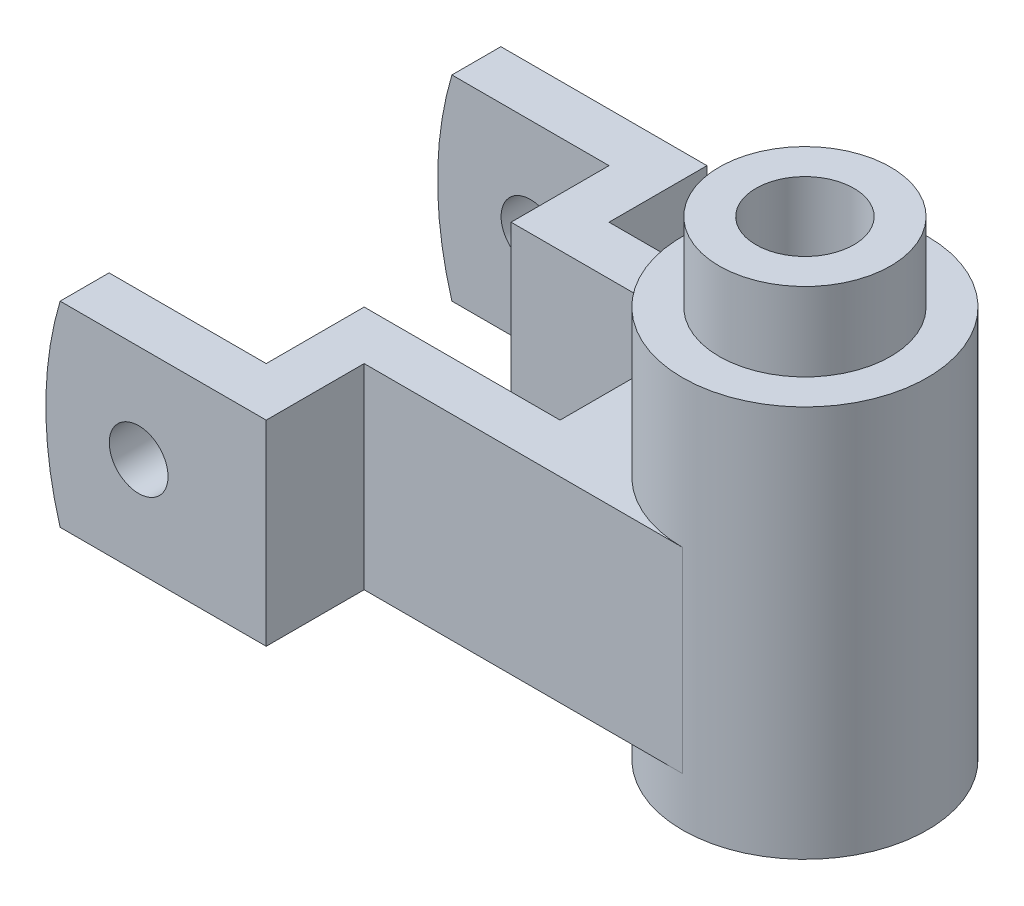
ISO-10303-21;
HEADER;
FILE_DESCRIPTION(('STEP AP214'),'2;1');
FILE_NAME('part.step','',(''),(''),'','','');
FILE_SCHEMA(('AUTOMOTIVE_DESIGN { 1 0 10303 214 1 1 1 1 }'));
ENDSEC;
DATA;
#1=APPLICATION_CONTEXT('core data for automotive mechanical design processes');
#2=APPLICATION_PROTOCOL_DEFINITION('international standard','automotive_design',2000,#1);
#3=PRODUCT_CONTEXT('',#1,'mechanical');
#4=PRODUCT('Part','Part','',(#3));
#5=PRODUCT_RELATED_PRODUCT_CATEGORY('part','',(#4));
#6=PRODUCT_DEFINITION_FORMATION('','',#4);
#7=PRODUCT_DEFINITION_CONTEXT('part definition',#1,'design');
#8=PRODUCT_DEFINITION('design','',#6,#7);
#9=PRODUCT_DEFINITION_SHAPE('','',#8);
#10=(LENGTH_UNIT() NAMED_UNIT(*) SI_UNIT(.MILLI.,.METRE.));
#11=(NAMED_UNIT(*) PLANE_ANGLE_UNIT() SI_UNIT($,.RADIAN.));
#12=(NAMED_UNIT(*) SI_UNIT($,.STERADIAN.) SOLID_ANGLE_UNIT());
#13=UNCERTAINTY_MEASURE_WITH_UNIT(LENGTH_MEASURE(1.E-05),#10,'distance_accuracy_value','');
#14=(GEOMETRIC_REPRESENTATION_CONTEXT(3) GLOBAL_UNCERTAINTY_ASSIGNED_CONTEXT((#13)) GLOBAL_UNIT_ASSIGNED_CONTEXT((#10,
#11,#12)) REPRESENTATION_CONTEXT('',''));
#15=CARTESIAN_POINT('',(0.,0.,0.));
#16=DIRECTION('',(0.,0.,1.));
#17=DIRECTION('',(1.,0.,0.));
#18=AXIS2_PLACEMENT_3D('',#15,#16,#17);
#19=CARTESIAN_POINT('',(-56.2735173731658,40.,-36.0168659088266));
#20=DIRECTION('',(0.,0.,1.));
#21=DIRECTION('',(1.,0.,0.));
#22=AXIS2_PLACEMENT_3D('',#19,#20,#21);
#23=PLANE('',#22);
#24=CARTESIAN_POINT('',(-37.3145370356626,20.,-36.0168659088266));
#25=DIRECTION('',(0.,0.,1.));
#26=DIRECTION('',(1.,0.,0.));
#27=AXIS2_PLACEMENT_3D('',#24,#25,#26);
#28=CIRCLE('',#27,6.);
#29=CARTESIAN_POINT('',(-31.3145370356626,20.,-36.0168659088266));
#30=VERTEX_POINT('',#29);
#31=EDGE_CURVE('E254',#30,#30,#28,.F.);
#32=ORIENTED_EDGE('',*,*,#31,.F.);
#33=EDGE_LOOP('',(#32));
#34=FACE_BOUND('',#33,.T.);
#35=CARTESIAN_POINT('',(13.7264826268342,20.,-36.0168659088266));
#36=DIRECTION('',(0.,0.,1.));
#37=DIRECTION('',(1.,0.,0.));
#38=AXIS2_PLACEMENT_3D('',#35,#36,#37);
#39=CIRCLE('',#38,70.);
#40=CARTESIAN_POINT('',(-53.3555566981594,40.,-36.0168659088266));
#41=VERTEX_POINT('',#40);
#42=CARTESIAN_POINT('',(-53.3555566981594,0.,-36.0168659088266));
#43=VERTEX_POINT('',#42);
#44=EDGE_CURVE('E60',#41,#43,#39,.T.);
#45=ORIENTED_EDGE('',*,*,#44,.F.);
#46=DIRECTION('',(-1.,0.,0.));
#47=VECTOR('',#46,1.);
#48=CARTESIAN_POINT('',(-56.2735173731658,40.,-36.0168659088266));
#49=LINE('',#48,#47);
#50=CARTESIAN_POINT('',(-11.2735173731658,40.,-36.0168659088266));
#51=VERTEX_POINT('',#50);
#52=EDGE_CURVE('E212',#51,#41,#49,.T.);
#53=ORIENTED_EDGE('',*,*,#52,.F.);
#54=DIRECTION('',(0.,-1.,0.));
#55=VECTOR('',#54,1.);
#56=CARTESIAN_POINT('',(-11.2735173731658,40.,-36.0168659088266));
#57=LINE('',#56,#55);
#58=CARTESIAN_POINT('',(-11.2735173731658,0.,-36.0168659088266));
#59=VERTEX_POINT('',#58);
#60=EDGE_CURVE('E176',#51,#59,#57,.T.);
#61=ORIENTED_EDGE('',*,*,#60,.T.);
#62=DIRECTION('',(-1.,0.,0.));
#63=VECTOR('',#62,1.);
#64=CARTESIAN_POINT('',(-56.2735173731658,0.,-36.0168659088266));
#65=LINE('',#64,#63);
#66=EDGE_CURVE('E182',#59,#43,#65,.T.);
#67=ORIENTED_EDGE('',*,*,#66,.T.);
#68=EDGE_LOOP('',(#45,#53,#61,#67));
#69=FACE_BOUND('',#68,.T.);
#70=ADVANCED_FACE('F37',(#34,#69),#23,.F.);
#71=CARTESIAN_POINT('',(-56.2735173731658,40.,-26.0168659088266));
#72=DIRECTION('',(0.,0.,-1.));
#73=DIRECTION('',(-1.,0.,0.));
#74=AXIS2_PLACEMENT_3D('',#71,#72,#73);
#75=PLANE('',#74);
#76=CARTESIAN_POINT('',(-37.3145370356626,20.,-26.0168659088266));
#77=DIRECTION('',(0.,0.,-1.));
#78=DIRECTION('',(-1.,0.,0.));
#79=AXIS2_PLACEMENT_3D('',#76,#77,#78);
#80=CIRCLE('',#79,6.);
#81=CARTESIAN_POINT('',(-43.3145370356626,20.,-26.0168659088266));
#82=VERTEX_POINT('',#81);
#83=EDGE_CURVE('E249',#82,#82,#80,.F.);
#84=ORIENTED_EDGE('',*,*,#83,.F.);
#85=EDGE_LOOP('',(#84));
#86=FACE_BOUND('',#85,.T.);
#87=DIRECTION('',(1.,0.,0.));
#88=VECTOR('',#87,1.);
#89=CARTESIAN_POINT('',(-56.2735173731658,40.,-26.0168659088266));
#90=LINE('',#89,#88);
#91=CARTESIAN_POINT('',(-53.3555566981594,40.,-26.0168659088266));
#92=VERTEX_POINT('',#91);
#93=CARTESIAN_POINT('',(-21.2735173731658,40.,-26.0168659088266));
#94=VERTEX_POINT('',#93);
#95=EDGE_CURVE('E273',#92,#94,#90,.T.);
#96=ORIENTED_EDGE('',*,*,#95,.F.);
#97=CARTESIAN_POINT('',(13.7264826268342,20.,-26.0168659088266));
#98=DIRECTION('',(0.,0.,-1.));
#99=DIRECTION('',(-1.,0.,0.));
#100=AXIS2_PLACEMENT_3D('',#97,#98,#99);
#101=CIRCLE('',#100,70.);
#102=CARTESIAN_POINT('',(-53.3555566981594,0.,-26.0168659088266));
#103=VERTEX_POINT('',#102);
#104=EDGE_CURVE('E186',#103,#92,#101,.T.);
#105=ORIENTED_EDGE('',*,*,#104,.F.);
#106=DIRECTION('',(1.,0.,0.));
#107=VECTOR('',#106,1.);
#108=CARTESIAN_POINT('',(-56.2735173731658,0.,-26.0168659088266));
#109=LINE('',#108,#107);
#110=CARTESIAN_POINT('',(-21.2735173731658,0.,-26.0168659088266));
#111=VERTEX_POINT('',#110);
#112=EDGE_CURVE('E185',#103,#111,#109,.T.);
#113=ORIENTED_EDGE('',*,*,#112,.T.);
#114=DIRECTION('',(0.,-1.,0.));
#115=VECTOR('',#114,1.);
#116=CARTESIAN_POINT('',(-21.2735173731658,40.,-26.0168659088266));
#117=LINE('',#116,#115);
#118=EDGE_CURVE('E238',#94,#111,#117,.T.);
#119=ORIENTED_EDGE('',*,*,#118,.F.);
#120=EDGE_LOOP('',(#96,#105,#113,#119));
#121=FACE_BOUND('',#120,.T.);
#122=ADVANCED_FACE('F337',(#86,#121),#75,.F.);
#123=CARTESIAN_POINT('',(-21.2735173731658,40.,43.9831340911734));
#124=DIRECTION('',(0.,0.,1.));
#125=DIRECTION('',(1.,0.,0.));
#126=AXIS2_PLACEMENT_3D('',#123,#124,#125);
#127=PLANE('',#126);
#128=CARTESIAN_POINT('',(-37.3145370356626,20.,43.9831340911734));
#129=DIRECTION('',(0.,0.,1.));
#130=DIRECTION('',(1.,0.,0.));
#131=AXIS2_PLACEMENT_3D('',#128,#129,#130);
#132=CIRCLE('',#131,6.);
#133=CARTESIAN_POINT('',(-31.3145370356626,20.,43.9831340911734));
#134=VERTEX_POINT('',#133);
#135=EDGE_CURVE('E245',#134,#134,#132,.F.);
#136=ORIENTED_EDGE('',*,*,#135,.F.);
#137=EDGE_LOOP('',(#136));
#138=FACE_BOUND('',#137,.T.);
#139=CARTESIAN_POINT('',(13.7264826268342,20.,43.9831340911734));
#140=DIRECTION('',(0.,0.,1.));
#141=DIRECTION('',(1.,0.,0.));
#142=AXIS2_PLACEMENT_3D('',#139,#140,#141);
#143=CIRCLE('',#142,70.);
#144=CARTESIAN_POINT('',(-53.3555566981594,40.,43.9831340911733));
#145=VERTEX_POINT('',#144);
#146=CARTESIAN_POINT('',(-53.3555566981594,0.,43.9831340911734));
#147=VERTEX_POINT('',#146);
#148=EDGE_CURVE('E52',#145,#147,#143,.T.);
#149=ORIENTED_EDGE('',*,*,#148,.F.);
#150=DIRECTION('',(-1.,0.,0.));
#151=VECTOR('',#150,1.);
#152=CARTESIAN_POINT('',(-21.2735173731658,40.,43.9831340911734));
#153=LINE('',#152,#151);
#154=CARTESIAN_POINT('',(-21.2735173731658,40.,43.9831340911734));
#155=VERTEX_POINT('',#154);
#156=EDGE_CURVE('E285',#155,#145,#153,.T.);
#157=ORIENTED_EDGE('',*,*,#156,.F.);
#158=DIRECTION('',(0.,-1.,0.));
#159=VECTOR('',#158,1.);
#160=CARTESIAN_POINT('',(-21.2735173731658,40.,43.9831340911734));
#161=LINE('',#160,#159);
#162=CARTESIAN_POINT('',(-21.2735173731658,0.,43.9831340911734));
#163=VERTEX_POINT('',#162);
#164=EDGE_CURVE('E223',#155,#163,#161,.T.);
#165=ORIENTED_EDGE('',*,*,#164,.T.);
#166=DIRECTION('',(-1.,0.,0.));
#167=VECTOR('',#166,1.);
#168=CARTESIAN_POINT('',(-21.2735173731658,0.,43.9831340911734));
#169=LINE('',#168,#167);
#170=EDGE_CURVE('E198',#163,#147,#169,.T.);
#171=ORIENTED_EDGE('',*,*,#170,.T.);
#172=EDGE_LOOP('',(#149,#157,#165,#171));
#173=FACE_BOUND('',#172,.T.);
#174=ADVANCED_FACE('F342',(#138,#173),#127,.F.);
#175=CARTESIAN_POINT('',(-56.2735173731658,40.,53.9831340911734));
#176=DIRECTION('',(0.,0.,-1.));
#177=DIRECTION('',(-1.,0.,0.));
#178=AXIS2_PLACEMENT_3D('',#175,#176,#177);
#179=PLANE('',#178);
#180=CARTESIAN_POINT('',(-37.3145370356626,20.,53.9831340911734));
#181=DIRECTION('',(0.,0.,-1.));
#182=DIRECTION('',(-1.,0.,0.));
#183=AXIS2_PLACEMENT_3D('',#180,#181,#182);
#184=CIRCLE('',#183,6.);
#185=CARTESIAN_POINT('',(-43.3145370356626,20.,53.9831340911734));
#186=VERTEX_POINT('',#185);
#187=EDGE_CURVE('E169',#186,#186,#184,.F.);
#188=ORIENTED_EDGE('',*,*,#187,.F.);
#189=EDGE_LOOP('',(#188));
#190=FACE_BOUND('',#189,.T.);
#191=DIRECTION('',(1.,0.,0.));
#192=VECTOR('',#191,1.);
#193=CARTESIAN_POINT('',(-56.2735173731658,40.,53.9831340911734));
#194=LINE('',#193,#192);
#195=CARTESIAN_POINT('',(-53.3555566981594,40.,53.9831340911734));
#196=VERTEX_POINT('',#195);
#197=CARTESIAN_POINT('',(-11.2735173731658,40.,53.9831340911734));
#198=VERTEX_POINT('',#197);
#199=EDGE_CURVE('E288',#196,#198,#194,.T.);
#200=ORIENTED_EDGE('',*,*,#199,.F.);
#201=CARTESIAN_POINT('',(13.7264826268342,20.,53.9831340911734));
#202=DIRECTION('',(0.,0.,1.));
#203=DIRECTION('',(1.,0.,0.));
#204=AXIS2_PLACEMENT_3D('',#201,#202,#203);
#205=CIRCLE('',#204,70.);
#206=CARTESIAN_POINT('',(-53.3555566981594,0.,53.9831340911734));
#207=VERTEX_POINT('',#206);
#208=EDGE_CURVE('E263',#196,#207,#205,.T.);
#209=ORIENTED_EDGE('',*,*,#208,.T.);
#210=DIRECTION('',(1.,0.,0.));
#211=VECTOR('',#210,1.);
#212=CARTESIAN_POINT('',(-56.2735173731658,0.,53.9831340911734));
#213=LINE('',#212,#211);
#214=CARTESIAN_POINT('',(-11.2735173731658,0.,53.9831340911734));
#215=VERTEX_POINT('',#214);
#216=EDGE_CURVE('E201',#207,#215,#213,.T.);
#217=ORIENTED_EDGE('',*,*,#216,.T.);
#218=DIRECTION('',(0.,-1.,0.));
#219=VECTOR('',#218,1.);
#220=CARTESIAN_POINT('',(-11.2735173731658,40.,53.9831340911734));
#221=LINE('',#220,#219);
#222=EDGE_CURVE('E220',#198,#215,#221,.T.);
#223=ORIENTED_EDGE('',*,*,#222,.F.);
#224=EDGE_LOOP('',(#200,#209,#217,#223));
#225=FACE_BOUND('',#224,.T.);
#226=ADVANCED_FACE('F386',(#190,#225),#179,.F.);
#227=CARTESIAN_POINT('',(0.,40.,0.));
#228=DIRECTION('',(0.,-1.,0.));
#229=DIRECTION('',(0.,0.,-1.));
#230=AXIS2_PLACEMENT_3D('',#227,#228,#229);
#231=PLANE('',#230);
#232=CARTESIAN_POINT('',(53.7264826268342,40.,8.98313409117337));
#233=DIRECTION('',(0.,-1.,0.));
#234=DIRECTION('',(0.,0.,-1.));
#235=AXIS2_PLACEMENT_3D('',#232,#233,#234);
#236=CIRCLE('',#235,25.);
#237=CARTESIAN_POINT('',(53.7264826268342,40.,-16.0168659088266));
#238=VERTEX_POINT('',#237);
#239=CARTESIAN_POINT('',(53.7264826268342,40.,33.9831340911734));
#240=VERTEX_POINT('',#239);
#241=EDGE_CURVE('E152',#238,#240,#236,.F.);
#242=ORIENTED_EDGE('',*,*,#241,.F.);
#243=DIRECTION('',(-1.,0.,0.));
#244=VECTOR('',#243,1.);
#245=CARTESIAN_POINT('',(-11.2735173731658,40.,-16.0168659088266));
#246=LINE('',#245,#244);
#247=CARTESIAN_POINT('',(-11.2735173731658,40.,-16.0168659088266));
#248=VERTEX_POINT('',#247);
#249=EDGE_CURVE('E164',#238,#248,#246,.T.);
#250=ORIENTED_EDGE('',*,*,#249,.T.);
#251=DIRECTION('',(0.,0.,-1.));
#252=VECTOR('',#251,1.);
#253=CARTESIAN_POINT('',(-11.2735173731658,40.,-36.0168659088266));
#254=LINE('',#253,#252);
#255=EDGE_CURVE('E174',#248,#51,#254,.T.);
#256=ORIENTED_EDGE('',*,*,#255,.T.);
#257=ORIENTED_EDGE('',*,*,#52,.T.);
#258=DIRECTION('',(0.,0.,1.));
#259=VECTOR('',#258,1.);
#260=CARTESIAN_POINT('',(-53.3555566981594,40.,-36.0168659088266));
#261=LINE('',#260,#259);
#262=EDGE_CURVE('E260',#41,#92,#261,.T.);
#263=ORIENTED_EDGE('',*,*,#262,.T.);
#264=ORIENTED_EDGE('',*,*,#95,.T.);
#265=DIRECTION('',(0.,0.,1.));
#266=VECTOR('',#265,1.);
#267=CARTESIAN_POINT('',(-21.2735173731658,40.,-26.0168659088266));
#268=LINE('',#267,#266);
#269=CARTESIAN_POINT('',(-21.2735173731658,40.,-6.01686590882664));
#270=VERTEX_POINT('',#269);
#271=EDGE_CURVE('E275',#94,#270,#268,.T.);
#272=ORIENTED_EDGE('',*,*,#271,.T.);
#273=DIRECTION('',(1.,0.,0.));
#274=VECTOR('',#273,1.);
#275=CARTESIAN_POINT('',(-21.2735173731658,40.,-6.01686590882664));
#276=LINE('',#275,#274);
#277=CARTESIAN_POINT('',(18.7264826268342,40.,-6.01686590882664));
#278=VERTEX_POINT('',#277);
#279=EDGE_CURVE('E277',#270,#278,#276,.T.);
#280=ORIENTED_EDGE('',*,*,#279,.T.);
#281=DIRECTION('',(0.,0.,1.));
#282=VECTOR('',#281,1.);
#283=CARTESIAN_POINT('',(18.7264826268342,40.,-6.01686590882664));
#284=LINE('',#283,#282);
#285=CARTESIAN_POINT('',(18.7264826268342,40.,23.9831340911734));
#286=VERTEX_POINT('',#285);
#287=EDGE_CURVE('E279',#278,#286,#284,.T.);
#288=ORIENTED_EDGE('',*,*,#287,.T.);
#289=DIRECTION('',(-1.,0.,0.));
#290=VECTOR('',#289,1.);
#291=CARTESIAN_POINT('',(18.7264826268342,40.,23.9831340911734));
#292=LINE('',#291,#290);
#293=CARTESIAN_POINT('',(-21.2735173731658,40.,23.9831340911734));
#294=VERTEX_POINT('',#293);
#295=EDGE_CURVE('E281',#286,#294,#292,.T.);
#296=ORIENTED_EDGE('',*,*,#295,.T.);
#297=DIRECTION('',(0.,0.,1.));
#298=VECTOR('',#297,1.);
#299=CARTESIAN_POINT('',(-21.2735173731658,40.,23.9831340911734));
#300=LINE('',#299,#298);
#301=EDGE_CURVE('E283',#294,#155,#300,.T.);
#302=ORIENTED_EDGE('',*,*,#301,.T.);
#303=ORIENTED_EDGE('',*,*,#156,.T.);
#304=DIRECTION('',(0.,0.,1.));
#305=VECTOR('',#304,1.);
#306=CARTESIAN_POINT('',(-53.3555566981594,40.,-36.0168659088266));
#307=LINE('',#306,#305);
#308=EDGE_CURVE('E45',#196,#145,#307,.F.);
#309=ORIENTED_EDGE('',*,*,#308,.F.);
#310=ORIENTED_EDGE('',*,*,#199,.T.);
#311=DIRECTION('',(0.,0.,-1.));
#312=VECTOR('',#311,1.);
#313=CARTESIAN_POINT('',(-11.2735173731658,40.,53.9831340911734));
#314=LINE('',#313,#312);
#315=CARTESIAN_POINT('',(-11.2735173731658,40.,33.9831340911734));
#316=VERTEX_POINT('',#315);
#317=EDGE_CURVE('E178',#198,#316,#314,.T.);
#318=ORIENTED_EDGE('',*,*,#317,.T.);
#319=DIRECTION('',(1.,0.,0.));
#320=VECTOR('',#319,1.);
#321=CARTESIAN_POINT('',(-11.2735173731658,40.,33.9831340911734));
#322=LINE('',#321,#320);
#323=EDGE_CURVE('E167',#316,#240,#322,.T.);
#324=ORIENTED_EDGE('',*,*,#323,.T.);
#325=EDGE_LOOP('',(#242,#250,#256,#257,#263,#264,#272,#280,#288,#296,#302,#303,#309,#310,#318,#324));
#326=FACE_BOUND('',#325,.T.);
#327=ADVANCED_FACE('F163',(#326),#231,.F.);
#328=CARTESIAN_POINT('',(0.,0.,0.));
#329=DIRECTION('',(0.,-1.,0.));
#330=DIRECTION('',(0.,0.,-1.));
#331=AXIS2_PLACEMENT_3D('',#328,#329,#330);
#332=PLANE('',#331);
#333=DIRECTION('',(-1.,0.,0.));
#334=VECTOR('',#333,1.);
#335=CARTESIAN_POINT('',(-11.2735173731658,0.,-16.0168659088266));
#336=LINE('',#335,#334);
#337=CARTESIAN_POINT('',(53.7264826268342,0.,-16.0168659088266));
#338=VERTEX_POINT('',#337);
#339=CARTESIAN_POINT('',(-11.2735173731658,0.,-16.0168659088266));
#340=VERTEX_POINT('',#339);
#341=EDGE_CURVE('E208',#338,#340,#336,.T.);
#342=ORIENTED_EDGE('',*,*,#341,.F.);
#343=CARTESIAN_POINT('',(53.7264826268342,0.,8.98313409117337));
#344=DIRECTION('',(0.,-1.,0.));
#345=DIRECTION('',(0.,0.,-1.));
#346=AXIS2_PLACEMENT_3D('',#343,#344,#345);
#347=CIRCLE('',#346,25.);
#348=CARTESIAN_POINT('',(53.7264826268342,0.,33.9831340911734));
#349=VERTEX_POINT('',#348);
#350=EDGE_CURVE('E155',#338,#349,#347,.F.);
#351=ORIENTED_EDGE('',*,*,#350,.T.);
#352=DIRECTION('',(1.,0.,0.));
#353=VECTOR('',#352,1.);
#354=CARTESIAN_POINT('',(-11.2735173731658,0.,33.9831340911734));
#355=LINE('',#354,#353);
#356=CARTESIAN_POINT('',(-11.2735173731658,0.,33.9831340911734));
#357=VERTEX_POINT('',#356);
#358=EDGE_CURVE('E205',#357,#349,#355,.T.);
#359=ORIENTED_EDGE('',*,*,#358,.F.);
#360=DIRECTION('',(0.,0.,-1.));
#361=VECTOR('',#360,1.);
#362=CARTESIAN_POINT('',(-11.2735173731658,0.,53.9831340911734));
#363=LINE('',#362,#361);
#364=EDGE_CURVE('E203',#215,#357,#363,.T.);
#365=ORIENTED_EDGE('',*,*,#364,.F.);
#366=ORIENTED_EDGE('',*,*,#216,.F.);
#367=DIRECTION('',(0.,0.,1.));
#368=VECTOR('',#367,1.);
#369=CARTESIAN_POINT('',(-53.3555566981594,0.,-36.0168659088266));
#370=LINE('',#369,#368);
#371=EDGE_CURVE('E241',#207,#147,#370,.F.);
#372=ORIENTED_EDGE('',*,*,#371,.T.);
#373=ORIENTED_EDGE('',*,*,#170,.F.);
#374=DIRECTION('',(0.,0.,1.));
#375=VECTOR('',#374,1.);
#376=CARTESIAN_POINT('',(-21.2735173731658,0.,23.9831340911734));
#377=LINE('',#376,#375);
#378=CARTESIAN_POINT('',(-21.2735173731658,0.,23.9831340911734));
#379=VERTEX_POINT('',#378);
#380=EDGE_CURVE('E196',#379,#163,#377,.T.);
#381=ORIENTED_EDGE('',*,*,#380,.F.);
#382=DIRECTION('',(-1.,0.,0.));
#383=VECTOR('',#382,1.);
#384=CARTESIAN_POINT('',(18.7264826268342,0.,23.9831340911734));
#385=LINE('',#384,#383);
#386=CARTESIAN_POINT('',(18.7264826268342,0.,23.9831340911734));
#387=VERTEX_POINT('',#386);
#388=EDGE_CURVE('E194',#387,#379,#385,.T.);
#389=ORIENTED_EDGE('',*,*,#388,.F.);
#390=DIRECTION('',(0.,0.,1.));
#391=VECTOR('',#390,1.);
#392=CARTESIAN_POINT('',(18.7264826268342,0.,-6.01686590882664));
#393=LINE('',#392,#391);
#394=CARTESIAN_POINT('',(18.7264826268342,0.,-6.01686590882664));
#395=VERTEX_POINT('',#394);
#396=EDGE_CURVE('E192',#395,#387,#393,.T.);
#397=ORIENTED_EDGE('',*,*,#396,.F.);
#398=DIRECTION('',(1.,0.,0.));
#399=VECTOR('',#398,1.);
#400=CARTESIAN_POINT('',(-21.2735173731658,0.,-6.01686590882664));
#401=LINE('',#400,#399);
#402=CARTESIAN_POINT('',(-21.2735173731658,0.,-6.01686590882664));
#403=VERTEX_POINT('',#402);
#404=EDGE_CURVE('E190',#403,#395,#401,.T.);
#405=ORIENTED_EDGE('',*,*,#404,.F.);
#406=DIRECTION('',(0.,0.,1.));
#407=VECTOR('',#406,1.);
#408=CARTESIAN_POINT('',(-21.2735173731658,0.,-26.0168659088266));
#409=LINE('',#408,#407);
#410=EDGE_CURVE('E188',#111,#403,#409,.T.);
#411=ORIENTED_EDGE('',*,*,#410,.F.);
#412=ORIENTED_EDGE('',*,*,#112,.F.);
#413=DIRECTION('',(0.,0.,1.));
#414=VECTOR('',#413,1.);
#415=CARTESIAN_POINT('',(-53.3555566981594,0.,-36.0168659088266));
#416=LINE('',#415,#414);
#417=EDGE_CURVE('E265',#43,#103,#416,.T.);
#418=ORIENTED_EDGE('',*,*,#417,.F.);
#419=ORIENTED_EDGE('',*,*,#66,.F.);
#420=DIRECTION('',(0.,0.,-1.));
#421=VECTOR('',#420,1.);
#422=CARTESIAN_POINT('',(-11.2735173731658,0.,-36.0168659088266));
#423=LINE('',#422,#421);
#424=EDGE_CURVE('E210',#340,#59,#423,.T.);
#425=ORIENTED_EDGE('',*,*,#424,.F.);
#426=EDGE_LOOP('',(#342,#351,#359,#365,#366,#372,#373,#381,#389,#397,#405,#411,#412,#418,#419,#425));
#427=FACE_BOUND('',#426,.T.);
#428=ADVANCED_FACE('F301',(#427),#332,.T.);
#429=CARTESIAN_POINT('',(-21.2735173731658,40.,-26.0168659088266));
#430=DIRECTION('',(1.,0.,0.));
#431=DIRECTION('',(0.,0.,-1.));
#432=AXIS2_PLACEMENT_3D('',#429,#430,#431);
#433=PLANE('',#432);
#434=ORIENTED_EDGE('',*,*,#410,.T.);
#435=DIRECTION('',(0.,-1.,0.));
#436=VECTOR('',#435,1.);
#437=CARTESIAN_POINT('',(-21.2735173731658,40.,-6.01686590882664));
#438=LINE('',#437,#436);
#439=EDGE_CURVE('E235',#270,#403,#438,.T.);
#440=ORIENTED_EDGE('',*,*,#439,.F.);
#441=ORIENTED_EDGE('',*,*,#271,.F.);
#442=ORIENTED_EDGE('',*,*,#118,.T.);
#443=EDGE_LOOP('',(#434,#440,#441,#442));
#444=FACE_BOUND('',#443,.T.);
#445=ADVANCED_FACE('F363',(#444),#433,.F.);
#446=CARTESIAN_POINT('',(-21.2735173731658,40.,-6.01686590882664));
#447=DIRECTION('',(0.,0.,-1.));
#448=DIRECTION('',(-1.,0.,0.));
#449=AXIS2_PLACEMENT_3D('',#446,#447,#448);
#450=PLANE('',#449);
#451=ORIENTED_EDGE('',*,*,#404,.T.);
#452=DIRECTION('',(0.,-1.,0.));
#453=VECTOR('',#452,1.);
#454=CARTESIAN_POINT('',(18.7264826268342,40.,-6.01686590882664));
#455=LINE('',#454,#453);
#456=EDGE_CURVE('E232',#278,#395,#455,.T.);
#457=ORIENTED_EDGE('',*,*,#456,.F.);
#458=ORIENTED_EDGE('',*,*,#279,.F.);
#459=ORIENTED_EDGE('',*,*,#439,.T.);
#460=EDGE_LOOP('',(#451,#457,#458,#459));
#461=FACE_BOUND('',#460,.T.);
#462=ADVANCED_FACE('F366',(#461),#450,.F.);
#463=CARTESIAN_POINT('',(18.7264826268342,40.,-6.01686590882664));
#464=DIRECTION('',(1.,0.,0.));
#465=DIRECTION('',(0.,0.,-1.));
#466=AXIS2_PLACEMENT_3D('',#463,#464,#465);
#467=PLANE('',#466);
#468=ORIENTED_EDGE('',*,*,#396,.T.);
#469=DIRECTION('',(0.,-1.,0.));
#470=VECTOR('',#469,1.);
#471=CARTESIAN_POINT('',(18.7264826268342,40.,23.9831340911734));
#472=LINE('',#471,#470);
#473=EDGE_CURVE('E229',#286,#387,#472,.T.);
#474=ORIENTED_EDGE('',*,*,#473,.F.);
#475=ORIENTED_EDGE('',*,*,#287,.F.);
#476=ORIENTED_EDGE('',*,*,#456,.T.);
#477=EDGE_LOOP('',(#468,#474,#475,#476));
#478=FACE_BOUND('',#477,.T.);
#479=ADVANCED_FACE('F371',(#478),#467,.F.);
#480=CARTESIAN_POINT('',(18.7264826268342,40.,23.9831340911734));
#481=DIRECTION('',(0.,0.,1.));
#482=DIRECTION('',(1.,0.,0.));
#483=AXIS2_PLACEMENT_3D('',#480,#481,#482);
#484=PLANE('',#483);
#485=ORIENTED_EDGE('',*,*,#388,.T.);
#486=DIRECTION('',(0.,-1.,0.));
#487=VECTOR('',#486,1.);
#488=CARTESIAN_POINT('',(-21.2735173731658,40.,23.9831340911734));
#489=LINE('',#488,#487);
#490=EDGE_CURVE('E226',#294,#379,#489,.T.);
#491=ORIENTED_EDGE('',*,*,#490,.F.);
#492=ORIENTED_EDGE('',*,*,#295,.F.);
#493=ORIENTED_EDGE('',*,*,#473,.T.);
#494=EDGE_LOOP('',(#485,#491,#492,#493));
#495=FACE_BOUND('',#494,.T.);
#496=ADVANCED_FACE('F377',(#495),#484,.F.);
#497=CARTESIAN_POINT('',(-21.2735173731658,40.,23.9831340911734));
#498=DIRECTION('',(1.,0.,0.));
#499=DIRECTION('',(0.,0.,-1.));
#500=AXIS2_PLACEMENT_3D('',#497,#498,#499);
#501=PLANE('',#500);
#502=ORIENTED_EDGE('',*,*,#380,.T.);
#503=ORIENTED_EDGE('',*,*,#164,.F.);
#504=ORIENTED_EDGE('',*,*,#301,.F.);
#505=ORIENTED_EDGE('',*,*,#490,.T.);
#506=EDGE_LOOP('',(#502,#503,#504,#505));
#507=FACE_BOUND('',#506,.T.);
#508=ADVANCED_FACE('F381',(#507),#501,.F.);
#509=CARTESIAN_POINT('',(-11.2735173731658,40.,53.9831340911734));
#510=DIRECTION('',(-1.,0.,0.));
#511=DIRECTION('',(0.,0.,1.));
#512=AXIS2_PLACEMENT_3D('',#509,#510,#511);
#513=PLANE('',#512);
#514=ORIENTED_EDGE('',*,*,#364,.T.);
#515=DIRECTION('',(0.,-1.,0.));
#516=VECTOR('',#515,1.);
#517=CARTESIAN_POINT('',(-11.2735173731658,40.,33.9831340911734));
#518=LINE('',#517,#516);
#519=EDGE_CURVE('E217',#316,#357,#518,.T.);
#520=ORIENTED_EDGE('',*,*,#519,.F.);
#521=ORIENTED_EDGE('',*,*,#317,.F.);
#522=ORIENTED_EDGE('',*,*,#222,.T.);
#523=EDGE_LOOP('',(#514,#520,#521,#522));
#524=FACE_BOUND('',#523,.T.);
#525=ADVANCED_FACE('F295',(#524),#513,.F.);
#526=CARTESIAN_POINT('',(-11.2735173731658,40.,33.9831340911734));
#527=DIRECTION('',(0.,0.,-1.));
#528=DIRECTION('',(-1.,0.,0.));
#529=AXIS2_PLACEMENT_3D('',#526,#527,#528);
#530=PLANE('',#529);
#531=ORIENTED_EDGE('',*,*,#358,.T.);
#532=DIRECTION('',(0.,-1.,0.));
#533=VECTOR('',#532,1.);
#534=CARTESIAN_POINT('',(53.7264826268342,40.,33.9831340911734));
#535=LINE('',#534,#533);
#536=EDGE_CURVE('E159',#240,#349,#535,.T.);
#537=ORIENTED_EDGE('',*,*,#536,.F.);
#538=ORIENTED_EDGE('',*,*,#323,.F.);
#539=ORIENTED_EDGE('',*,*,#519,.T.);
#540=EDGE_LOOP('',(#531,#537,#538,#539));
#541=FACE_BOUND('',#540,.T.);
#542=ADVANCED_FACE('F299',(#541),#530,.F.);
#543=CARTESIAN_POINT('',(-11.2735173731658,40.,-16.0168659088266));
#544=DIRECTION('',(0.,0.,1.));
#545=DIRECTION('',(1.,0.,0.));
#546=AXIS2_PLACEMENT_3D('',#543,#544,#545);
#547=PLANE('',#546);
#548=ORIENTED_EDGE('',*,*,#341,.T.);
#549=DIRECTION('',(0.,-1.,0.));
#550=VECTOR('',#549,1.);
#551=CARTESIAN_POINT('',(-11.2735173731658,40.,-16.0168659088266));
#552=LINE('',#551,#550);
#553=EDGE_CURVE('E160',#248,#340,#552,.T.);
#554=ORIENTED_EDGE('',*,*,#553,.F.);
#555=ORIENTED_EDGE('',*,*,#249,.F.);
#556=DIRECTION('',(0.,-1.,0.));
#557=VECTOR('',#556,1.);
#558=CARTESIAN_POINT('',(53.7264826268342,40.,-16.0168659088266));
#559=LINE('',#558,#557);
#560=EDGE_CURVE('E149',#238,#338,#559,.T.);
#561=ORIENTED_EDGE('',*,*,#560,.T.);
#562=EDGE_LOOP('',(#548,#554,#555,#561));
#563=FACE_BOUND('',#562,.T.);
#564=ADVANCED_FACE('F171',(#563),#547,.F.);
#565=CARTESIAN_POINT('',(-11.2735173731658,40.,-36.0168659088266));
#566=DIRECTION('',(-1.,0.,0.));
#567=DIRECTION('',(0.,0.,1.));
#568=AXIS2_PLACEMENT_3D('',#565,#566,#567);
#569=PLANE('',#568);
#570=ORIENTED_EDGE('',*,*,#424,.T.);
#571=ORIENTED_EDGE('',*,*,#60,.F.);
#572=ORIENTED_EDGE('',*,*,#255,.F.);
#573=ORIENTED_EDGE('',*,*,#553,.T.);
#574=EDGE_LOOP('',(#570,#571,#572,#573));
#575=FACE_BOUND('',#574,.T.);
#576=ADVANCED_FACE('F353',(#575),#569,.F.);
#577=CARTESIAN_POINT('',(13.7264826268342,20.,-36.0168659088266));
#578=DIRECTION('',(0.,0.,1.));
#579=DIRECTION('',(1.,0.,0.));
#580=AXIS2_PLACEMENT_3D('',#577,#578,#579);
#581=CYLINDRICAL_SURFACE('',#580,70.);
#582=ORIENTED_EDGE('',*,*,#104,.T.);
#583=ORIENTED_EDGE('',*,*,#262,.F.);
#584=ORIENTED_EDGE('',*,*,#44,.T.);
#585=ORIENTED_EDGE('',*,*,#417,.T.);
#586=EDGE_LOOP('',(#582,#583,#584,#585));
#587=FACE_BOUND('',#586,.T.);
#588=ADVANCED_FACE('F348',(#587),#581,.T.);
#589=ORIENTED_EDGE('',*,*,#148,.T.);
#590=ORIENTED_EDGE('',*,*,#371,.F.);
#591=ORIENTED_EDGE('',*,*,#208,.F.);
#592=ORIENTED_EDGE('',*,*,#308,.T.);
#593=EDGE_LOOP('',(#589,#590,#591,#592));
#594=FACE_BOUND('',#593,.T.);
#595=ADVANCED_FACE('F388',(#594),#581,.T.);
#596=CARTESIAN_POINT('',(-37.3145370356626,20.,124.983134091173));
#597=DIRECTION('',(0.,0.,-1.));
#598=DIRECTION('',(-1.,0.,0.));
#599=AXIS2_PLACEMENT_3D('',#596,#597,#598);
#600=CYLINDRICAL_SURFACE('',#599,6.);
#601=ORIENTED_EDGE('',*,*,#187,.T.);
#602=EDGE_LOOP('',(#601));
#603=FACE_BOUND('',#602,.T.);
#604=ORIENTED_EDGE('',*,*,#135,.T.);
#605=EDGE_LOOP('',(#604));
#606=FACE_BOUND('',#605,.T.);
#607=ADVANCED_FACE('F390',(#603,#606),#600,.F.);
#608=ORIENTED_EDGE('',*,*,#83,.T.);
#609=EDGE_LOOP('',(#608));
#610=FACE_BOUND('',#609,.T.);
#611=ORIENTED_EDGE('',*,*,#31,.T.);
#612=EDGE_LOOP('',(#611));
#613=FACE_BOUND('',#612,.T.);
#614=ADVANCED_FACE('F396',(#610,#613),#600,.F.);
#615=CARTESIAN_POINT('',(53.7264826268342,40.,8.98313409117337));
#616=DIRECTION('',(0.,-1.,0.));
#617=DIRECTION('',(0.,0.,-1.));
#618=AXIS2_PLACEMENT_3D('',#615,#616,#617);
#619=CYLINDRICAL_SURFACE('',#618,25.);
#620=CARTESIAN_POINT('',(53.7264826268342,-10.,8.98313409117337));
#621=DIRECTION('',(0.,1.,0.));
#622=DIRECTION('',(0.,0.,1.));
#623=AXIS2_PLACEMENT_3D('',#620,#621,#622);
#624=CIRCLE('',#623,25.);
#625=CARTESIAN_POINT('',(53.7264826268342,-10.,33.9831340911734));
#626=VERTEX_POINT('',#625);
#627=EDGE_CURVE('E303',#626,#626,#624,.T.);
#628=ORIENTED_EDGE('',*,*,#627,.T.);
#629=EDGE_LOOP('',(#628));
#630=FACE_BOUND('',#629,.T.);
#631=CARTESIAN_POINT('',(53.7264826268342,70.,8.98313409117337));
#632=DIRECTION('',(0.,1.,0.));
#633=DIRECTION('',(0.,0.,1.));
#634=AXIS2_PLACEMENT_3D('',#631,#632,#633);
#635=CIRCLE('',#634,25.);
#636=CARTESIAN_POINT('',(53.7264826268342,70.,33.9831340911734));
#637=VERTEX_POINT('',#636);
#638=EDGE_CURVE('E305',#637,#637,#635,.T.);
#639=ORIENTED_EDGE('',*,*,#638,.F.);
#640=EDGE_LOOP('',(#639));
#641=FACE_BOUND('',#640,.T.);
#642=ORIENTED_EDGE('',*,*,#241,.T.);
#643=ORIENTED_EDGE('',*,*,#536,.T.);
#644=ORIENTED_EDGE('',*,*,#350,.F.);
#645=ORIENTED_EDGE('',*,*,#560,.F.);
#646=EDGE_LOOP('',(#642,#643,#644,#645));
#647=FACE_BOUND('',#646,.T.);
#648=ADVANCED_FACE('F151',(#630,#641,#647),#619,.T.);
#649=CARTESIAN_POINT('',(0.,-10.,0.));
#650=DIRECTION('',(0.,1.,0.));
#651=DIRECTION('',(0.,0.,1.));
#652=AXIS2_PLACEMENT_3D('',#649,#650,#651);
#653=PLANE('',#652);
#654=ORIENTED_EDGE('',*,*,#627,.F.);
#655=EDGE_LOOP('',(#654));
#656=FACE_BOUND('',#655,.T.);
#657=ADVANCED_FACE('F331',(#656),#653,.F.);
#658=CARTESIAN_POINT('',(0.,70.,0.));
#659=DIRECTION('',(0.,1.,0.));
#660=DIRECTION('',(0.,0.,1.));
#661=AXIS2_PLACEMENT_3D('',#658,#659,#660);
#662=PLANE('',#661);
#663=CARTESIAN_POINT('',(53.7264826268342,70.,8.98313409117337));
#664=DIRECTION('',(0.,1.,0.));
#665=DIRECTION('',(0.,0.,1.));
#666=AXIS2_PLACEMENT_3D('',#663,#664,#665);
#667=CIRCLE('',#666,17.5);
#668=CARTESIAN_POINT('',(53.7264826268342,70.,26.4831340911734));
#669=VERTEX_POINT('',#668);
#670=EDGE_CURVE('E40',#669,#669,#667,.F.);
#671=ORIENTED_EDGE('',*,*,#670,.T.);
#672=EDGE_LOOP('',(#671));
#673=FACE_BOUND('',#672,.T.);
#674=ORIENTED_EDGE('',*,*,#638,.T.);
#675=EDGE_LOOP('',(#674));
#676=FACE_BOUND('',#675,.T.);
#677=ADVANCED_FACE('F322',(#673,#676),#662,.T.);
#678=CARTESIAN_POINT('',(53.7264826268342,86.,8.98313409117337));
#679=DIRECTION('',(0.,1.,0.));
#680=DIRECTION('',(0.,0.,1.));
#681=AXIS2_PLACEMENT_3D('',#678,#679,#680);
#682=PLANE('',#681);
#683=CARTESIAN_POINT('',(53.7264826268342,86.,8.98313409117337));
#684=DIRECTION('',(0.,1.,0.));
#685=DIRECTION('',(0.,0.,1.));
#686=AXIS2_PLACEMENT_3D('',#683,#684,#685);
#687=CIRCLE('',#686,17.5);
#688=CARTESIAN_POINT('',(53.7264826268342,86.,26.4831340911734));
#689=VERTEX_POINT('',#688);
#690=EDGE_CURVE('E310',#689,#689,#687,.T.);
#691=ORIENTED_EDGE('',*,*,#690,.T.);
#692=EDGE_LOOP('',(#691));
#693=FACE_BOUND('',#692,.T.);
#694=CARTESIAN_POINT('',(53.7264826268342,86.,8.98313409117337));
#695=DIRECTION('',(0.,1.,0.));
#696=DIRECTION('',(0.,0.,1.));
#697=AXIS2_PLACEMENT_3D('',#694,#695,#696);
#698=CIRCLE('',#697,9.99999999999999);
#699=CARTESIAN_POINT('',(53.7264826268342,86.,18.9831340911734));
#700=VERTEX_POINT('',#699);
#701=EDGE_CURVE('E313',#700,#700,#698,.T.);
#702=ORIENTED_EDGE('',*,*,#701,.F.);
#703=EDGE_LOOP('',(#702));
#704=FACE_BOUND('',#703,.T.);
#705=ADVANCED_FACE('F319',(#693,#704),#682,.T.);
#706=CARTESIAN_POINT('',(53.7264826268342,86.,8.98313409117337));
#707=DIRECTION('',(0.,-1.,0.));
#708=DIRECTION('',(0.,0.,-1.));
#709=AXIS2_PLACEMENT_3D('',#706,#707,#708);
#710=CYLINDRICAL_SURFACE('',#709,17.5);
#711=ORIENTED_EDGE('',*,*,#670,.F.);
#712=EDGE_LOOP('',(#711));
#713=FACE_BOUND('',#712,.T.);
#714=ORIENTED_EDGE('',*,*,#690,.F.);
#715=EDGE_LOOP('',(#714));
#716=FACE_BOUND('',#715,.T.);
#717=ADVANCED_FACE('F321',(#713,#716),#710,.T.);
#718=CARTESIAN_POINT('',(53.7264826268342,86.,8.98313409117337));
#719=DIRECTION('',(0.,-1.,0.));
#720=DIRECTION('',(0.,0.,-1.));
#721=AXIS2_PLACEMENT_3D('',#718,#719,#720);
#722=CYLINDRICAL_SURFACE('',#721,9.99999999999999);
#723=CARTESIAN_POINT('',(53.7264826268342,70.,8.98313409117337));
#724=DIRECTION('',(0.,1.,0.));
#725=DIRECTION('',(0.,0.,1.));
#726=AXIS2_PLACEMENT_3D('',#723,#724,#725);
#727=CIRCLE('',#726,9.99999999999999);
#728=CARTESIAN_POINT('',(53.7264826268342,70.,18.9831340911734));
#729=VERTEX_POINT('',#728);
#730=EDGE_CURVE('E12',#729,#729,#727,.F.);
#731=ORIENTED_EDGE('',*,*,#730,.T.);
#732=EDGE_LOOP('',(#731));
#733=FACE_BOUND('',#732,.T.);
#734=ORIENTED_EDGE('',*,*,#701,.T.);
#735=EDGE_LOOP('',(#734));
#736=FACE_BOUND('',#735,.T.);
#737=ADVANCED_FACE('F317',(#733,#736),#722,.F.);
#738=ORIENTED_EDGE('',*,*,#730,.F.);
#739=EDGE_LOOP('',(#738));
#740=FACE_BOUND('',#739,.T.);
#741=ADVANCED_FACE('F334',(#740),#662,.T.);
#742=CLOSED_SHELL('',(#70,#122,#174,#226,#327,#428,#445,#462,#479,#496,#508,#525,#542,#564,#576,
#588,#595,#607,#614,#648,#657,#677,#705,#717,#737,#741));
#743=MANIFOLD_SOLID_BREP('B2',#742);
#744=ADVANCED_BREP_SHAPE_REPRESENTATION('',(#18,#743),#14);
#745=SHAPE_DEFINITION_REPRESENTATION(#9,#744);
ENDSEC;
END-ISO-10303-21;
